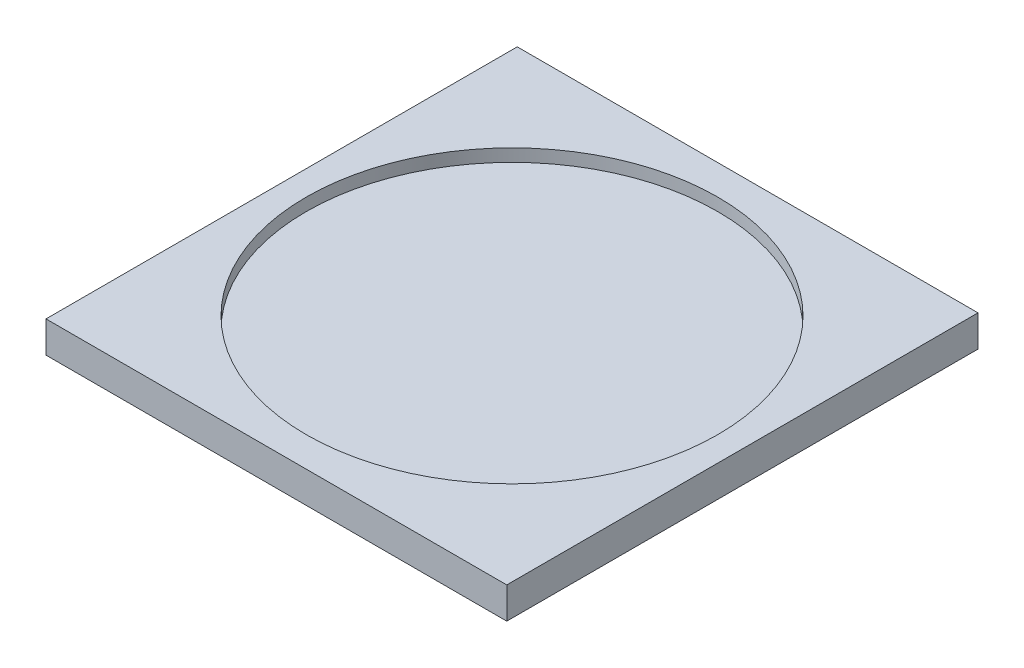
ISO-10303-21;
HEADER;
FILE_DESCRIPTION(('STEP AP214'),'2;1');
FILE_NAME('part.step','',(''),(''),'','','');
FILE_SCHEMA(('AUTOMOTIVE_DESIGN { 1 0 10303 214 1 1 1 1 }'));
ENDSEC;
DATA;
#1=APPLICATION_CONTEXT('core data for automotive mechanical design processes');
#2=APPLICATION_PROTOCOL_DEFINITION('international standard','automotive_design',2000,#1);
#3=PRODUCT_CONTEXT('',#1,'mechanical');
#4=PRODUCT('Part','Part','',(#3));
#5=PRODUCT_RELATED_PRODUCT_CATEGORY('part','',(#4));
#6=PRODUCT_DEFINITION_FORMATION('','',#4);
#7=PRODUCT_DEFINITION_CONTEXT('part definition',#1,'design');
#8=PRODUCT_DEFINITION('design','',#6,#7);
#9=PRODUCT_DEFINITION_SHAPE('','',#8);
#10=(LENGTH_UNIT() NAMED_UNIT(*) SI_UNIT(.MILLI.,.METRE.));
#11=(NAMED_UNIT(*) PLANE_ANGLE_UNIT() SI_UNIT($,.RADIAN.));
#12=(NAMED_UNIT(*) SI_UNIT($,.STERADIAN.) SOLID_ANGLE_UNIT());
#13=UNCERTAINTY_MEASURE_WITH_UNIT(LENGTH_MEASURE(1.E-05),#10,'distance_accuracy_value','');
#14=(GEOMETRIC_REPRESENTATION_CONTEXT(3) GLOBAL_UNCERTAINTY_ASSIGNED_CONTEXT((#13)) GLOBAL_UNIT_ASSIGNED_CONTEXT((#10,
#11,#12)) REPRESENTATION_CONTEXT('',''));
#15=CARTESIAN_POINT('',(0.,0.,0.));
#16=DIRECTION('',(0.,0.,1.));
#17=DIRECTION('',(1.,0.,0.));
#18=AXIS2_PLACEMENT_3D('',#15,#16,#17);
#19=CARTESIAN_POINT('',(0.,5.,0.));
#20=DIRECTION('',(-1.,0.,0.));
#21=DIRECTION('',(0.,0.,1.));
#22=AXIS2_PLACEMENT_3D('',#19,#20,#21);
#23=PLANE('',#22);
#24=DIRECTION('',(0.,0.,-1.));
#25=VECTOR('',#24,1.);
#26=CARTESIAN_POINT('',(0.,0.,0.));
#27=LINE('',#26,#25);
#28=CARTESIAN_POINT('',(0.,0.,0.));
#29=VERTEX_POINT('',#28);
#30=CARTESIAN_POINT('',(0.,0.,-75.));
#31=VERTEX_POINT('',#30);
#32=EDGE_CURVE('E96',#29,#31,#27,.T.);
#33=ORIENTED_EDGE('',*,*,#32,.T.);
#34=DIRECTION('',(0.,-1.,0.));
#35=VECTOR('',#34,1.);
#36=CARTESIAN_POINT('',(0.,5.,-75.));
#37=LINE('',#36,#35);
#38=CARTESIAN_POINT('',(0.,5.,-75.));
#39=VERTEX_POINT('',#38);
#40=EDGE_CURVE('E11',#39,#31,#37,.T.);
#41=ORIENTED_EDGE('',*,*,#40,.F.);
#42=DIRECTION('',(0.,0.,-1.));
#43=VECTOR('',#42,1.);
#44=CARTESIAN_POINT('',(0.,5.,0.));
#45=LINE('',#44,#43);
#46=CARTESIAN_POINT('',(0.,5.,0.));
#47=VERTEX_POINT('',#46);
#48=EDGE_CURVE('E84',#47,#39,#45,.T.);
#49=ORIENTED_EDGE('',*,*,#48,.F.);
#50=DIRECTION('',(0.,-1.,0.));
#51=VECTOR('',#50,1.);
#52=CARTESIAN_POINT('',(0.,5.,0.));
#53=LINE('',#52,#51);
#54=EDGE_CURVE('E92',#47,#29,#53,.T.);
#55=ORIENTED_EDGE('',*,*,#54,.T.);
#56=EDGE_LOOP('',(#33,#41,#49,#55));
#57=FACE_BOUND('',#56,.T.);
#58=ADVANCED_FACE('F33',(#57),#23,.F.);
#59=CARTESIAN_POINT('',(0.,5.,-75.));
#60=DIRECTION('',(0.,0.,1.));
#61=DIRECTION('',(1.,0.,0.));
#62=AXIS2_PLACEMENT_3D('',#59,#60,#61);
#63=PLANE('',#62);
#64=DIRECTION('',(-1.,0.,0.));
#65=VECTOR('',#64,1.);
#66=CARTESIAN_POINT('',(0.,0.,-75.));
#67=LINE('',#66,#65);
#68=CARTESIAN_POINT('',(-73.3333333334,0.,-75.));
#69=VERTEX_POINT('',#68);
#70=EDGE_CURVE('E88',#31,#69,#67,.T.);
#71=ORIENTED_EDGE('',*,*,#70,.T.);
#72=DIRECTION('',(0.,-1.,0.));
#73=VECTOR('',#72,1.);
#74=CARTESIAN_POINT('',(-73.3333333334,5.,-75.));
#75=LINE('',#74,#73);
#76=CARTESIAN_POINT('',(-73.3333333334,5.,-75.));
#77=VERTEX_POINT('',#76);
#78=EDGE_CURVE('E41',#77,#69,#75,.T.);
#79=ORIENTED_EDGE('',*,*,#78,.F.);
#80=DIRECTION('',(-1.,0.,0.));
#81=VECTOR('',#80,1.);
#82=CARTESIAN_POINT('',(0.,5.,-75.));
#83=LINE('',#82,#81);
#84=EDGE_CURVE('E79',#39,#77,#83,.T.);
#85=ORIENTED_EDGE('',*,*,#84,.F.);
#86=ORIENTED_EDGE('',*,*,#40,.T.);
#87=EDGE_LOOP('',(#71,#79,#85,#86));
#88=FACE_BOUND('',#87,.T.);
#89=ADVANCED_FACE('F87',(#88),#63,.F.);
#90=CARTESIAN_POINT('',(-73.3333333334,5.,0.));
#91=DIRECTION('',(1.,0.,0.));
#92=DIRECTION('',(0.,0.,-1.));
#93=AXIS2_PLACEMENT_3D('',#90,#91,#92);
#94=PLANE('',#93);
#95=DIRECTION('',(0.,0.,1.));
#96=VECTOR('',#95,1.);
#97=CARTESIAN_POINT('',(-73.3333333334,0.,0.));
#98=LINE('',#97,#96);
#99=CARTESIAN_POINT('',(-73.3333333334,0.,0.));
#100=VERTEX_POINT('',#99);
#101=EDGE_CURVE('E66',#69,#100,#98,.T.);
#102=ORIENTED_EDGE('',*,*,#101,.T.);
#103=DIRECTION('',(0.,-1.,0.));
#104=VECTOR('',#103,1.);
#105=CARTESIAN_POINT('',(-73.3333333334,5.,0.));
#106=LINE('',#105,#104);
#107=CARTESIAN_POINT('',(-73.3333333334,5.,0.));
#108=VERTEX_POINT('',#107);
#109=EDGE_CURVE('E89',#108,#100,#106,.T.);
#110=ORIENTED_EDGE('',*,*,#109,.F.);
#111=DIRECTION('',(0.,0.,1.));
#112=VECTOR('',#111,1.);
#113=CARTESIAN_POINT('',(-73.3333333334,5.,0.));
#114=LINE('',#113,#112);
#115=EDGE_CURVE('E82',#77,#108,#114,.T.);
#116=ORIENTED_EDGE('',*,*,#115,.F.);
#117=ORIENTED_EDGE('',*,*,#78,.T.);
#118=EDGE_LOOP('',(#102,#110,#116,#117));
#119=FACE_BOUND('',#118,.T.);
#120=ADVANCED_FACE('F90',(#119),#94,.F.);
#121=CARTESIAN_POINT('',(0.,5.,0.));
#122=DIRECTION('',(0.,0.,-1.));
#123=DIRECTION('',(-1.,0.,0.));
#124=AXIS2_PLACEMENT_3D('',#121,#122,#123);
#125=PLANE('',#124);
#126=DIRECTION('',(1.,0.,0.));
#127=VECTOR('',#126,1.);
#128=CARTESIAN_POINT('',(0.,0.,0.));
#129=LINE('',#128,#127);
#130=EDGE_CURVE('E72',#100,#29,#129,.T.);
#131=ORIENTED_EDGE('',*,*,#130,.T.);
#132=ORIENTED_EDGE('',*,*,#54,.F.);
#133=DIRECTION('',(1.,0.,0.));
#134=VECTOR('',#133,1.);
#135=CARTESIAN_POINT('',(0.,5.,0.));
#136=LINE('',#135,#134);
#137=EDGE_CURVE('E49',#108,#47,#136,.T.);
#138=ORIENTED_EDGE('',*,*,#137,.F.);
#139=ORIENTED_EDGE('',*,*,#109,.T.);
#140=EDGE_LOOP('',(#131,#132,#138,#139));
#141=FACE_BOUND('',#140,.T.);
#142=ADVANCED_FACE('F104',(#141),#125,.F.);
#143=CARTESIAN_POINT('',(0.,5.,0.));
#144=DIRECTION('',(0.,1.,0.));
#145=DIRECTION('',(0.,0.,1.));
#146=AXIS2_PLACEMENT_3D('',#143,#144,#145);
#147=PLANE('',#146);
#148=CARTESIAN_POINT('',(-36.6666666667,5.,-37.5));
#149=DIRECTION('',(0.,1.,0.));
#150=DIRECTION('',(0.,0.,1.));
#151=AXIS2_PLACEMENT_3D('',#148,#149,#150);
#152=CIRCLE('',#151,32.75);
#153=CARTESIAN_POINT('',(-36.6666666667,5.,-4.74999999999998));
#154=VERTEX_POINT('',#153);
#155=EDGE_CURVE('E110',#154,#154,#152,.T.);
#156=ORIENTED_EDGE('',*,*,#155,.F.);
#157=EDGE_LOOP('',(#156));
#158=FACE_BOUND('',#157,.T.);
#159=ORIENTED_EDGE('',*,*,#48,.T.);
#160=ORIENTED_EDGE('',*,*,#84,.T.);
#161=ORIENTED_EDGE('',*,*,#115,.T.);
#162=ORIENTED_EDGE('',*,*,#137,.T.);
#163=EDGE_LOOP('',(#159,#160,#161,#162));
#164=FACE_BOUND('',#163,.T.);
#165=ADVANCED_FACE('F80',(#158,#164),#147,.T.);
#166=CARTESIAN_POINT('',(0.,0.,0.));
#167=DIRECTION('',(0.,1.,0.));
#168=DIRECTION('',(0.,0.,1.));
#169=AXIS2_PLACEMENT_3D('',#166,#167,#168);
#170=PLANE('',#169);
#171=ORIENTED_EDGE('',*,*,#32,.F.);
#172=ORIENTED_EDGE('',*,*,#130,.F.);
#173=ORIENTED_EDGE('',*,*,#101,.F.);
#174=ORIENTED_EDGE('',*,*,#70,.F.);
#175=EDGE_LOOP('',(#171,#172,#173,#174));
#176=FACE_BOUND('',#175,.T.);
#177=ADVANCED_FACE('F107',(#176),#170,.F.);
#178=CARTESIAN_POINT('',(-36.6666666667,3.,-37.5));
#179=DIRECTION('',(0.,1.,0.));
#180=DIRECTION('',(0.,0.,1.));
#181=AXIS2_PLACEMENT_3D('',#178,#179,#180);
#182=CYLINDRICAL_SURFACE('',#181,32.75);
#183=CARTESIAN_POINT('',(-36.6666666667,3.,-37.5));
#184=DIRECTION('',(0.,1.,0.));
#185=DIRECTION('',(0.,0.,1.));
#186=AXIS2_PLACEMENT_3D('',#183,#184,#185);
#187=CIRCLE('',#186,32.75);
#188=CARTESIAN_POINT('',(-36.6666666667,3.,-4.74999999999998));
#189=VERTEX_POINT('',#188);
#190=EDGE_CURVE('E99',#189,#189,#187,.T.);
#191=ORIENTED_EDGE('',*,*,#190,.F.);
#192=EDGE_LOOP('',(#191));
#193=FACE_BOUND('',#192,.T.);
#194=ORIENTED_EDGE('',*,*,#155,.T.);
#195=EDGE_LOOP('',(#194));
#196=FACE_BOUND('',#195,.T.);
#197=ADVANCED_FACE('F118',(#193,#196),#182,.F.);
#198=CARTESIAN_POINT('',(-36.6666666667,3.,-37.5));
#199=DIRECTION('',(0.,1.,0.));
#200=DIRECTION('',(0.,0.,1.));
#201=AXIS2_PLACEMENT_3D('',#198,#199,#200);
#202=PLANE('',#201);
#203=ORIENTED_EDGE('',*,*,#190,.T.);
#204=EDGE_LOOP('',(#203));
#205=FACE_BOUND('',#204,.T.);
#206=ADVANCED_FACE('F116',(#205),#202,.T.);
#207=CLOSED_SHELL('',(#58,#89,#120,#142,#165,#177,#197,#206));
#208=MANIFOLD_SOLID_BREP('B2',#207);
#209=ADVANCED_BREP_SHAPE_REPRESENTATION('',(#18,#208),#14);
#210=SHAPE_DEFINITION_REPRESENTATION(#9,#209);
ENDSEC;
END-ISO-10303-21;
